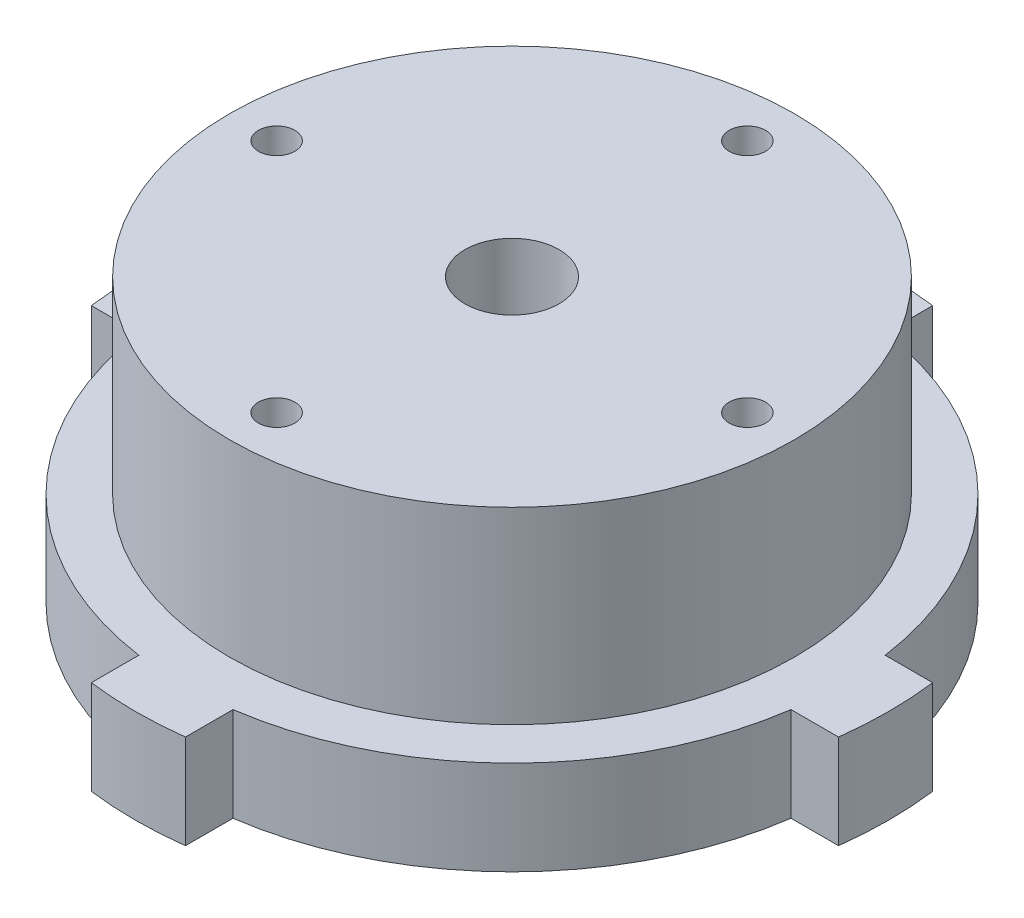
ISO-10303-21;
HEADER;
FILE_DESCRIPTION(('STEP AP214'),'2;1');
FILE_NAME('part.step','',(''),(''),'','','');
FILE_SCHEMA(('AUTOMOTIVE_DESIGN { 1 0 10303 214 1 1 1 1 }'));
ENDSEC;
DATA;
#1=APPLICATION_CONTEXT('core data for automotive mechanical design processes');
#2=APPLICATION_PROTOCOL_DEFINITION('international standard','automotive_design',2000,#1);
#3=PRODUCT_CONTEXT('',#1,'mechanical');
#4=PRODUCT('Part','Part','',(#3));
#5=PRODUCT_RELATED_PRODUCT_CATEGORY('part','',(#4));
#6=PRODUCT_DEFINITION_FORMATION('','',#4);
#7=PRODUCT_DEFINITION_CONTEXT('part definition',#1,'design');
#8=PRODUCT_DEFINITION('design','',#6,#7);
#9=PRODUCT_DEFINITION_SHAPE('','',#8);
#10=(LENGTH_UNIT() NAMED_UNIT(*) SI_UNIT(.MILLI.,.METRE.));
#11=(NAMED_UNIT(*) PLANE_ANGLE_UNIT() SI_UNIT($,.RADIAN.));
#12=(NAMED_UNIT(*) SI_UNIT($,.STERADIAN.) SOLID_ANGLE_UNIT());
#13=UNCERTAINTY_MEASURE_WITH_UNIT(LENGTH_MEASURE(1.E-05),#10,'distance_accuracy_value','');
#14=(GEOMETRIC_REPRESENTATION_CONTEXT(3) GLOBAL_UNCERTAINTY_ASSIGNED_CONTEXT((#13)) GLOBAL_UNIT_ASSIGNED_CONTEXT((#10,
#11,#12)) REPRESENTATION_CONTEXT('',''));
#15=CARTESIAN_POINT('',(0.,0.,0.));
#16=DIRECTION('',(0.,0.,1.));
#17=DIRECTION('',(1.,0.,0.));
#18=AXIS2_PLACEMENT_3D('',#15,#16,#17);
#19=CARTESIAN_POINT('',(0.,-12.7,0.));
#20=DIRECTION('',(0.,1.,0.));
#21=DIRECTION('',(0.,0.,1.));
#22=AXIS2_PLACEMENT_3D('',#19,#20,#21);
#23=PLANE('',#22);
#24=CARTESIAN_POINT('',(31.75,-12.7,3.32563597524808E-13));
#25=DIRECTION('',(0.,-1.,0.));
#26=DIRECTION('',(0.,0.,-1.));
#27=AXIS2_PLACEMENT_3D('',#24,#25,#26);
#28=CIRCLE('',#27,2.45744999999999);
#29=CARTESIAN_POINT('',(31.75,-12.7,-2.45744999999965));
#30=VERTEX_POINT('',#29);
#31=EDGE_CURVE('E563',#30,#30,#28,.T.);
#32=ORIENTED_EDGE('',*,*,#31,.F.);
#33=EDGE_LOOP('',(#32));
#34=FACE_BOUND('',#33,.T.);
#35=CARTESIAN_POINT('',(0.,-12.7,-31.75));
#36=DIRECTION('',(0.,-1.,0.));
#37=DIRECTION('',(0.,0.,-1.));
#38=AXIS2_PLACEMENT_3D('',#35,#36,#37);
#39=CIRCLE('',#38,2.45744999999999);
#40=CARTESIAN_POINT('',(0.,-12.7,-34.20745));
#41=VERTEX_POINT('',#40);
#42=EDGE_CURVE('E565',#41,#41,#39,.T.);
#43=ORIENTED_EDGE('',*,*,#42,.F.);
#44=EDGE_LOOP('',(#43));
#45=FACE_BOUND('',#44,.T.);
#46=CARTESIAN_POINT('',(-31.75,-12.7,-1.10854532508269E-13));
#47=DIRECTION('',(0.,-1.,0.));
#48=DIRECTION('',(0.,0.,-1.));
#49=AXIS2_PLACEMENT_3D('',#46,#47,#48);
#50=CIRCLE('',#49,2.45744999999999);
#51=CARTESIAN_POINT('',(-31.75,-12.7,-2.4574500000001));
#52=VERTEX_POINT('',#51);
#53=EDGE_CURVE('E573',#52,#52,#50,.T.);
#54=ORIENTED_EDGE('',*,*,#53,.F.);
#55=EDGE_LOOP('',(#54));
#56=FACE_BOUND('',#55,.T.);
#57=DIRECTION('',(-1.,0.,0.));
#58=VECTOR('',#57,1.);
#59=CARTESIAN_POINT('',(0.,-12.7,6.35000000000002));
#60=LINE('',#59,#58);
#61=CARTESIAN_POINT('',(50.4015624757804,-12.7,6.35000000000003));
#62=VERTEX_POINT('',#61);
#63=CARTESIAN_POINT('',(43.9940905122495,-12.7,6.35000000000003));
#64=VERTEX_POINT('',#63);
#65=EDGE_CURVE('E55',#62,#64,#60,.T.);
#66=ORIENTED_EDGE('',*,*,#65,.T.);
#67=CARTESIAN_POINT('',(0.,-12.7,0.));
#68=DIRECTION('',(0.,1.,0.));
#69=DIRECTION('',(0.,0.,1.));
#70=AXIS2_PLACEMENT_3D('',#67,#68,#69);
#71=CIRCLE('',#70,44.45);
#72=CARTESIAN_POINT('',(6.35,-12.7,43.9940905122495));
#73=VERTEX_POINT('',#72);
#74=EDGE_CURVE('E166',#73,#64,#71,.T.);
#75=ORIENTED_EDGE('',*,*,#74,.F.);
#76=DIRECTION('',(0.,0.,1.));
#77=VECTOR('',#76,1.);
#78=CARTESIAN_POINT('',(6.35,-12.7,0.));
#79=LINE('',#78,#77);
#80=CARTESIAN_POINT('',(6.35,-12.7,50.4015624757804));
#81=VERTEX_POINT('',#80);
#82=EDGE_CURVE('E161',#73,#81,#79,.T.);
#83=ORIENTED_EDGE('',*,*,#82,.T.);
#84=CARTESIAN_POINT('',(0.,-12.7,0.));
#85=DIRECTION('',(0.,1.,0.));
#86=DIRECTION('',(0.,0.,1.));
#87=AXIS2_PLACEMENT_3D('',#84,#85,#86);
#88=CIRCLE('',#87,50.8);
#89=CARTESIAN_POINT('',(-6.35,-12.7,50.4015624757804));
#90=VERTEX_POINT('',#89);
#91=EDGE_CURVE('E165',#90,#81,#88,.T.);
#92=ORIENTED_EDGE('',*,*,#91,.F.);
#93=DIRECTION('',(0.,0.,-1.));
#94=VECTOR('',#93,1.);
#95=CARTESIAN_POINT('',(-6.34999999999998,-12.7,0.));
#96=LINE('',#95,#94);
#97=CARTESIAN_POINT('',(-6.35,-12.7,43.9940905122495));
#98=VERTEX_POINT('',#97);
#99=EDGE_CURVE('E178',#90,#98,#96,.T.);
#100=ORIENTED_EDGE('',*,*,#99,.T.);
#101=CARTESIAN_POINT('',(0.,-12.7,0.));
#102=DIRECTION('',(0.,1.,0.));
#103=DIRECTION('',(0.,0.,1.));
#104=AXIS2_PLACEMENT_3D('',#101,#102,#103);
#105=CIRCLE('',#104,44.45);
#106=CARTESIAN_POINT('',(-43.9940905122495,-12.7,6.35000000000003));
#107=VERTEX_POINT('',#106);
#108=EDGE_CURVE('E182',#107,#98,#105,.T.);
#109=ORIENTED_EDGE('',*,*,#108,.F.);
#110=DIRECTION('',(-1.,0.,0.));
#111=VECTOR('',#110,1.);
#112=CARTESIAN_POINT('',(0.,-12.7,6.35000000000002));
#113=LINE('',#112,#111);
#114=CARTESIAN_POINT('',(-50.4015624757804,-12.7,6.35000000000003));
#115=VERTEX_POINT('',#114);
#116=EDGE_CURVE('E187',#107,#115,#113,.T.);
#117=ORIENTED_EDGE('',*,*,#116,.T.);
#118=CARTESIAN_POINT('',(-50.4015624757804,-12.7,-6.35000000000003));
#119=VERTEX_POINT('',#118);
#120=EDGE_CURVE('E180',#119,#115,#88,.T.);
#121=ORIENTED_EDGE('',*,*,#120,.F.);
#122=DIRECTION('',(1.,0.,0.));
#123=VECTOR('',#122,1.);
#124=CARTESIAN_POINT('',(0.,-12.7,-6.35000000000003));
#125=LINE('',#124,#123);
#126=CARTESIAN_POINT('',(-43.9940905122495,-12.7,-6.35000000000003));
#127=VERTEX_POINT('',#126);
#128=EDGE_CURVE('E188',#119,#127,#125,.T.);
#129=ORIENTED_EDGE('',*,*,#128,.T.);
#130=CARTESIAN_POINT('',(0.,-12.7,0.));
#131=DIRECTION('',(0.,1.,0.));
#132=DIRECTION('',(0.,0.,1.));
#133=AXIS2_PLACEMENT_3D('',#130,#131,#132);
#134=CIRCLE('',#133,44.45);
#135=CARTESIAN_POINT('',(-6.35,-12.7,-43.9940905122495));
#136=VERTEX_POINT('',#135);
#137=EDGE_CURVE('E198',#136,#127,#134,.T.);
#138=ORIENTED_EDGE('',*,*,#137,.F.);
#139=DIRECTION('',(0.,0.,-1.));
#140=VECTOR('',#139,1.);
#141=CARTESIAN_POINT('',(-6.35000000000001,-12.7,0.));
#142=LINE('',#141,#140);
#143=CARTESIAN_POINT('',(-6.35,-12.7,-50.4015624757804));
#144=VERTEX_POINT('',#143);
#145=EDGE_CURVE('E194',#136,#144,#142,.T.);
#146=ORIENTED_EDGE('',*,*,#145,.T.);
#147=CARTESIAN_POINT('',(6.35,-12.7,-50.4015624757804));
#148=VERTEX_POINT('',#147);
#149=EDGE_CURVE('E189',#148,#144,#88,.T.);
#150=ORIENTED_EDGE('',*,*,#149,.F.);
#151=DIRECTION('',(0.,0.,1.));
#152=VECTOR('',#151,1.);
#153=CARTESIAN_POINT('',(6.35,-12.7,0.));
#154=LINE('',#153,#152);
#155=CARTESIAN_POINT('',(6.35,-12.7,-43.9940905122495));
#156=VERTEX_POINT('',#155);
#157=EDGE_CURVE('E195',#148,#156,#154,.T.);
#158=ORIENTED_EDGE('',*,*,#157,.T.);
#159=CARTESIAN_POINT('',(0.,-12.7,0.));
#160=DIRECTION('',(0.,1.,0.));
#161=DIRECTION('',(0.,0.,1.));
#162=AXIS2_PLACEMENT_3D('',#159,#160,#161);
#163=CIRCLE('',#162,44.45);
#164=CARTESIAN_POINT('',(43.9940905122495,-12.7,-6.35000000000003));
#165=VERTEX_POINT('',#164);
#166=EDGE_CURVE('E191',#156,#165,#163,.F.);
#167=ORIENTED_EDGE('',*,*,#166,.T.);
#168=DIRECTION('',(1.,0.,0.));
#169=VECTOR('',#168,1.);
#170=CARTESIAN_POINT('',(0.,-12.7,-6.35000000000003));
#171=LINE('',#170,#169);
#172=CARTESIAN_POINT('',(50.4015624757804,-12.7,-6.35000000000003));
#173=VERTEX_POINT('',#172);
#174=EDGE_CURVE('E190',#165,#173,#171,.T.);
#175=ORIENTED_EDGE('',*,*,#174,.T.);
#176=EDGE_CURVE('E181',#62,#173,#88,.T.);
#177=ORIENTED_EDGE('',*,*,#176,.F.);
#178=EDGE_LOOP('',(#66,#75,#83,#92,#100,#109,#117,#121,#129,#138,#146,#150,#158,#167,#175,#177));
#179=FACE_BOUND('',#178,.T.);
#180=CARTESIAN_POINT('',(0.,-12.7,0.));
#181=DIRECTION('',(0.,1.,0.));
#182=DIRECTION('',(0.,0.,1.));
#183=AXIS2_PLACEMENT_3D('',#180,#181,#182);
#184=CIRCLE('',#183,6.35);
#185=CARTESIAN_POINT('',(0.,-12.7,6.35));
#186=VERTEX_POINT('',#185);
#187=EDGE_CURVE('E212',#186,#186,#184,.T.);
#188=ORIENTED_EDGE('',*,*,#187,.T.);
#189=EDGE_LOOP('',(#188));
#190=FACE_BOUND('',#189,.T.);
#191=CARTESIAN_POINT('',(0.,-12.7,31.75));
#192=DIRECTION('',(0.,-1.,0.));
#193=DIRECTION('',(0.,0.,-1.));
#194=AXIS2_PLACEMENT_3D('',#191,#192,#193);
#195=CIRCLE('',#194,2.45744999999999);
#196=CARTESIAN_POINT('',(0.,-12.7,29.29255));
#197=VERTEX_POINT('',#196);
#198=EDGE_CURVE('E579',#197,#197,#195,.T.);
#199=ORIENTED_EDGE('',*,*,#198,.F.);
#200=EDGE_LOOP('',(#199));
#201=FACE_BOUND('',#200,.T.);
#202=ADVANCED_FACE('F37',(#34,#45,#56,#179,#190,#201),#23,.F.);
#203=CARTESIAN_POINT('',(0.,25.4,0.));
#204=DIRECTION('',(0.,-1.,0.));
#205=DIRECTION('',(0.,0.,-1.));
#206=AXIS2_PLACEMENT_3D('',#203,#204,#205);
#207=CYLINDRICAL_SURFACE('',#206,6.35);
#208=CARTESIAN_POINT('',(0.,25.4,0.));
#209=DIRECTION('',(0.,1.,0.));
#210=DIRECTION('',(0.,0.,1.));
#211=AXIS2_PLACEMENT_3D('',#208,#209,#210);
#212=CIRCLE('',#211,6.35);
#213=CARTESIAN_POINT('',(0.,25.4,6.35));
#214=VERTEX_POINT('',#213);
#215=EDGE_CURVE('E47',#214,#214,#212,.T.);
#216=ORIENTED_EDGE('',*,*,#215,.T.);
#217=EDGE_LOOP('',(#216));
#218=FACE_BOUND('',#217,.T.);
#219=ORIENTED_EDGE('',*,*,#187,.F.);
#220=EDGE_LOOP('',(#219));
#221=FACE_BOUND('',#220,.T.);
#222=ADVANCED_FACE('F39',(#218,#221),#207,.F.);
#223=CARTESIAN_POINT('',(0.,25.4,0.));
#224=DIRECTION('',(0.,-1.,0.));
#225=DIRECTION('',(0.,0.,-1.));
#226=AXIS2_PLACEMENT_3D('',#223,#224,#225);
#227=CYLINDRICAL_SURFACE('',#226,38.1);
#228=CARTESIAN_POINT('',(0.,25.4,0.));
#229=DIRECTION('',(0.,1.,0.));
#230=DIRECTION('',(0.,0.,1.));
#231=AXIS2_PLACEMENT_3D('',#228,#229,#230);
#232=CIRCLE('',#231,38.1);
#233=CARTESIAN_POINT('',(0.,25.4,38.1));
#234=VERTEX_POINT('',#233);
#235=EDGE_CURVE('E11',#234,#234,#232,.T.);
#236=ORIENTED_EDGE('',*,*,#235,.F.);
#237=EDGE_LOOP('',(#236));
#238=FACE_BOUND('',#237,.T.);
#239=CARTESIAN_POINT('',(0.,0.,0.));
#240=DIRECTION('',(0.,1.,0.));
#241=DIRECTION('',(0.,0.,1.));
#242=AXIS2_PLACEMENT_3D('',#239,#240,#241);
#243=CIRCLE('',#242,38.1);
#244=CARTESIAN_POINT('',(0.,0.,38.1));
#245=VERTEX_POINT('',#244);
#246=EDGE_CURVE('E41',#245,#245,#243,.T.);
#247=ORIENTED_EDGE('',*,*,#246,.T.);
#248=EDGE_LOOP('',(#247));
#249=FACE_BOUND('',#248,.T.);
#250=ADVANCED_FACE('F286',(#238,#249),#227,.T.);
#251=CARTESIAN_POINT('',(0.,25.4,0.));
#252=DIRECTION('',(0.,1.,0.));
#253=DIRECTION('',(0.,0.,1.));
#254=AXIS2_PLACEMENT_3D('',#251,#252,#253);
#255=PLANE('',#254);
#256=CARTESIAN_POINT('',(31.75,25.4,3.32563597524808E-13));
#257=DIRECTION('',(0.,-1.,0.));
#258=DIRECTION('',(0.,0.,-1.));
#259=AXIS2_PLACEMENT_3D('',#256,#257,#258);
#260=CIRCLE('',#259,2.45744999999999);
#261=CARTESIAN_POINT('',(31.75,25.4,-2.45744999999966));
#262=VERTEX_POINT('',#261);
#263=EDGE_CURVE('E561',#262,#262,#260,.T.);
#264=ORIENTED_EDGE('',*,*,#263,.T.);
#265=EDGE_LOOP('',(#264));
#266=FACE_BOUND('',#265,.T.);
#267=CARTESIAN_POINT('',(0.,25.4,-31.75));
#268=DIRECTION('',(0.,-1.,0.));
#269=DIRECTION('',(0.,0.,-1.));
#270=AXIS2_PLACEMENT_3D('',#267,#268,#269);
#271=CIRCLE('',#270,2.45744999999999);
#272=CARTESIAN_POINT('',(0.,25.4,-34.20745));
#273=VERTEX_POINT('',#272);
#274=EDGE_CURVE('E570',#273,#273,#271,.T.);
#275=ORIENTED_EDGE('',*,*,#274,.T.);
#276=EDGE_LOOP('',(#275));
#277=FACE_BOUND('',#276,.T.);
#278=CARTESIAN_POINT('',(-31.75,25.4,-1.10854532508269E-13));
#279=DIRECTION('',(0.,-1.,0.));
#280=DIRECTION('',(0.,0.,-1.));
#281=AXIS2_PLACEMENT_3D('',#278,#279,#280);
#282=CIRCLE('',#281,2.45744999999999);
#283=CARTESIAN_POINT('',(-31.75,25.4,-2.4574500000001));
#284=VERTEX_POINT('',#283);
#285=EDGE_CURVE('E576',#284,#284,#282,.T.);
#286=ORIENTED_EDGE('',*,*,#285,.T.);
#287=EDGE_LOOP('',(#286));
#288=FACE_BOUND('',#287,.T.);
#289=CARTESIAN_POINT('',(0.,25.4,31.75));
#290=DIRECTION('',(0.,-1.,0.));
#291=DIRECTION('',(0.,0.,-1.));
#292=AXIS2_PLACEMENT_3D('',#289,#290,#291);
#293=CIRCLE('',#292,2.45744999999999);
#294=CARTESIAN_POINT('',(0.,25.4,29.29255));
#295=VERTEX_POINT('',#294);
#296=EDGE_CURVE('E218',#295,#295,#293,.T.);
#297=ORIENTED_EDGE('',*,*,#296,.T.);
#298=EDGE_LOOP('',(#297));
#299=FACE_BOUND('',#298,.T.);
#300=ORIENTED_EDGE('',*,*,#215,.F.);
#301=EDGE_LOOP('',(#300));
#302=FACE_BOUND('',#301,.T.);
#303=ORIENTED_EDGE('',*,*,#235,.T.);
#304=EDGE_LOOP('',(#303));
#305=FACE_BOUND('',#304,.T.);
#306=ADVANCED_FACE('F413',(#266,#277,#288,#299,#302,#305),#255,.T.);
#307=CARTESIAN_POINT('',(0.,-12.7,6.35000000000002));
#308=DIRECTION('',(0.,0.,-1.));
#309=DIRECTION('',(-1.,0.,0.));
#310=AXIS2_PLACEMENT_3D('',#307,#308,#309);
#311=PLANE('',#310);
#312=DIRECTION('',(-1.,0.,0.));
#313=VECTOR('',#312,1.);
#314=CARTESIAN_POINT('',(0.,0.,6.35000000000002));
#315=LINE('',#314,#313);
#316=CARTESIAN_POINT('',(50.4015624757804,0.,6.35000000000003));
#317=VERTEX_POINT('',#316);
#318=CARTESIAN_POINT('',(43.9940905122495,0.,6.35000000000003));
#319=VERTEX_POINT('',#318);
#320=EDGE_CURVE('E215',#317,#319,#315,.T.);
#321=ORIENTED_EDGE('',*,*,#320,.T.);
#322=DIRECTION('',(0.,1.,0.));
#323=VECTOR('',#322,1.);
#324=CARTESIAN_POINT('',(43.9940905122495,-12.7,6.35000000000003));
#325=LINE('',#324,#323);
#326=EDGE_CURVE('E115',#64,#319,#325,.T.);
#327=ORIENTED_EDGE('',*,*,#326,.F.);
#328=ORIENTED_EDGE('',*,*,#65,.F.);
#329=DIRECTION('',(0.,1.,0.));
#330=VECTOR('',#329,1.);
#331=CARTESIAN_POINT('',(50.4015624757804,-12.7,6.35000000000003));
#332=LINE('',#331,#330);
#333=EDGE_CURVE('E123',#62,#317,#332,.T.);
#334=ORIENTED_EDGE('',*,*,#333,.T.);
#335=EDGE_LOOP('',(#321,#327,#328,#334));
#336=FACE_BOUND('',#335,.T.);
#337=ADVANCED_FACE('F367',(#336),#311,.F.);
#338=CARTESIAN_POINT('',(0.,-12.7,0.));
#339=DIRECTION('',(0.,1.,0.));
#340=DIRECTION('',(0.,0.,1.));
#341=AXIS2_PLACEMENT_3D('',#338,#339,#340);
#342=CYLINDRICAL_SURFACE('',#341,44.45);
#343=CARTESIAN_POINT('',(0.,0.,0.));
#344=DIRECTION('',(0.,1.,0.));
#345=DIRECTION('',(0.,0.,1.));
#346=AXIS2_PLACEMENT_3D('',#343,#344,#345);
#347=CIRCLE('',#346,44.45);
#348=CARTESIAN_POINT('',(6.35,0.,43.9940905122495));
#349=VERTEX_POINT('',#348);
#350=EDGE_CURVE('E192',#349,#319,#347,.T.);
#351=ORIENTED_EDGE('',*,*,#350,.F.);
#352=DIRECTION('',(0.,1.,0.));
#353=VECTOR('',#352,1.);
#354=CARTESIAN_POINT('',(6.35,-12.7,43.9940905122495));
#355=LINE('',#354,#353);
#356=EDGE_CURVE('E108',#73,#349,#355,.T.);
#357=ORIENTED_EDGE('',*,*,#356,.F.);
#358=ORIENTED_EDGE('',*,*,#74,.T.);
#359=ORIENTED_EDGE('',*,*,#326,.T.);
#360=EDGE_LOOP('',(#351,#357,#358,#359));
#361=FACE_BOUND('',#360,.T.);
#362=ADVANCED_FACE('F364',(#361),#342,.T.);
#363=CARTESIAN_POINT('',(6.35,-12.7,0.));
#364=DIRECTION('',(-1.,0.,0.));
#365=DIRECTION('',(0.,0.,1.));
#366=AXIS2_PLACEMENT_3D('',#363,#364,#365);
#367=PLANE('',#366);
#368=DIRECTION('',(0.,0.,1.));
#369=VECTOR('',#368,1.);
#370=CARTESIAN_POINT('',(6.35,0.,0.));
#371=LINE('',#370,#369);
#372=CARTESIAN_POINT('',(6.35,0.,50.4015624757804));
#373=VERTEX_POINT('',#372);
#374=EDGE_CURVE('E170',#349,#373,#371,.T.);
#375=ORIENTED_EDGE('',*,*,#374,.T.);
#376=DIRECTION('',(0.,1.,0.));
#377=VECTOR('',#376,1.);
#378=CARTESIAN_POINT('',(6.35,-12.7,50.4015624757804));
#379=LINE('',#378,#377);
#380=EDGE_CURVE('E168',#81,#373,#379,.T.);
#381=ORIENTED_EDGE('',*,*,#380,.F.);
#382=ORIENTED_EDGE('',*,*,#82,.F.);
#383=ORIENTED_EDGE('',*,*,#356,.T.);
#384=EDGE_LOOP('',(#375,#381,#382,#383));
#385=FACE_BOUND('',#384,.T.);
#386=ADVANCED_FACE('F169',(#385),#367,.F.);
#387=CARTESIAN_POINT('',(0.,-12.7,0.));
#388=DIRECTION('',(0.,1.,0.));
#389=DIRECTION('',(0.,0.,1.));
#390=AXIS2_PLACEMENT_3D('',#387,#388,#389);
#391=CYLINDRICAL_SURFACE('',#390,50.8);
#392=CARTESIAN_POINT('',(0.,0.,0.));
#393=DIRECTION('',(0.,1.,0.));
#394=DIRECTION('',(0.,0.,1.));
#395=AXIS2_PLACEMENT_3D('',#392,#393,#394);
#396=CIRCLE('',#395,50.8);
#397=CARTESIAN_POINT('',(-6.35,0.,50.4015624757804));
#398=VERTEX_POINT('',#397);
#399=EDGE_CURVE('E222',#398,#373,#396,.T.);
#400=ORIENTED_EDGE('',*,*,#399,.F.);
#401=DIRECTION('',(0.,1.,0.));
#402=VECTOR('',#401,1.);
#403=CARTESIAN_POINT('',(-6.35,-12.7,50.4015624757804));
#404=LINE('',#403,#402);
#405=EDGE_CURVE('E174',#90,#398,#404,.T.);
#406=ORIENTED_EDGE('',*,*,#405,.F.);
#407=ORIENTED_EDGE('',*,*,#91,.T.);
#408=ORIENTED_EDGE('',*,*,#380,.T.);
#409=EDGE_LOOP('',(#400,#406,#407,#408));
#410=FACE_BOUND('',#409,.T.);
#411=ADVANCED_FACE('F176',(#410),#391,.T.);
#412=CARTESIAN_POINT('',(-6.34999999999998,-12.7,0.));
#413=DIRECTION('',(1.,0.,0.));
#414=DIRECTION('',(0.,0.,-1.));
#415=AXIS2_PLACEMENT_3D('',#412,#413,#414);
#416=PLANE('',#415);
#417=DIRECTION('',(0.,0.,-1.));
#418=VECTOR('',#417,1.);
#419=CARTESIAN_POINT('',(-6.34999999999998,0.,0.));
#420=LINE('',#419,#418);
#421=CARTESIAN_POINT('',(-6.35,0.,43.9940905122495));
#422=VERTEX_POINT('',#421);
#423=EDGE_CURVE('E246',#398,#422,#420,.T.);
#424=ORIENTED_EDGE('',*,*,#423,.T.);
#425=DIRECTION('',(0.,1.,0.));
#426=VECTOR('',#425,1.);
#427=CARTESIAN_POINT('',(-6.35,-12.7,43.9940905122495));
#428=LINE('',#427,#426);
#429=EDGE_CURVE('E255',#98,#422,#428,.T.);
#430=ORIENTED_EDGE('',*,*,#429,.F.);
#431=ORIENTED_EDGE('',*,*,#99,.F.);
#432=ORIENTED_EDGE('',*,*,#405,.T.);
#433=EDGE_LOOP('',(#424,#430,#431,#432));
#434=FACE_BOUND('',#433,.T.);
#435=ADVANCED_FACE('F322',(#434),#416,.F.);
#436=CARTESIAN_POINT('',(0.,-12.7,0.));
#437=DIRECTION('',(0.,1.,0.));
#438=DIRECTION('',(0.,0.,1.));
#439=AXIS2_PLACEMENT_3D('',#436,#437,#438);
#440=CYLINDRICAL_SURFACE('',#439,44.45);
#441=CARTESIAN_POINT('',(0.,0.,0.));
#442=DIRECTION('',(0.,1.,0.));
#443=DIRECTION('',(0.,0.,1.));
#444=AXIS2_PLACEMENT_3D('',#441,#442,#443);
#445=CIRCLE('',#444,44.45);
#446=CARTESIAN_POINT('',(-43.9940905122495,0.,6.35000000000003));
#447=VERTEX_POINT('',#446);
#448=EDGE_CURVE('E243',#447,#422,#445,.T.);
#449=ORIENTED_EDGE('',*,*,#448,.F.);
#450=DIRECTION('',(0.,1.,0.));
#451=VECTOR('',#450,1.);
#452=CARTESIAN_POINT('',(-43.9940905122495,-12.7,6.35000000000003));
#453=LINE('',#452,#451);
#454=EDGE_CURVE('E257',#107,#447,#453,.T.);
#455=ORIENTED_EDGE('',*,*,#454,.F.);
#456=ORIENTED_EDGE('',*,*,#108,.T.);
#457=ORIENTED_EDGE('',*,*,#429,.T.);
#458=EDGE_LOOP('',(#449,#455,#456,#457));
#459=FACE_BOUND('',#458,.T.);
#460=ADVANCED_FACE('F328',(#459),#440,.T.);
#461=CARTESIAN_POINT('',(0.,-12.7,6.35000000000002));
#462=DIRECTION('',(0.,0.,-1.));
#463=DIRECTION('',(-1.,0.,0.));
#464=AXIS2_PLACEMENT_3D('',#461,#462,#463);
#465=PLANE('',#464);
#466=DIRECTION('',(-1.,0.,0.));
#467=VECTOR('',#466,1.);
#468=CARTESIAN_POINT('',(0.,0.,6.35000000000002));
#469=LINE('',#468,#467);
#470=CARTESIAN_POINT('',(-50.4015624757804,0.,6.35000000000003));
#471=VERTEX_POINT('',#470);
#472=EDGE_CURVE('E240',#447,#471,#469,.T.);
#473=ORIENTED_EDGE('',*,*,#472,.T.);
#474=DIRECTION('',(0.,1.,0.));
#475=VECTOR('',#474,1.);
#476=CARTESIAN_POINT('',(-50.4015624757804,-12.7,6.35000000000003));
#477=LINE('',#476,#475);
#478=EDGE_CURVE('E259',#115,#471,#477,.T.);
#479=ORIENTED_EDGE('',*,*,#478,.F.);
#480=ORIENTED_EDGE('',*,*,#116,.F.);
#481=ORIENTED_EDGE('',*,*,#454,.T.);
#482=EDGE_LOOP('',(#473,#479,#480,#481));
#483=FACE_BOUND('',#482,.T.);
#484=ADVANCED_FACE('F330',(#483),#465,.F.);
#485=CARTESIAN_POINT('',(-50.4015624757804,0.,-6.35000000000003));
#486=VERTEX_POINT('',#485);
#487=EDGE_CURVE('E239',#486,#471,#396,.T.);
#488=ORIENTED_EDGE('',*,*,#487,.F.);
#489=DIRECTION('',(0.,1.,0.));
#490=VECTOR('',#489,1.);
#491=CARTESIAN_POINT('',(-50.4015624757804,-12.7,-6.35000000000003));
#492=LINE('',#491,#490);
#493=EDGE_CURVE('E261',#119,#486,#492,.T.);
#494=ORIENTED_EDGE('',*,*,#493,.F.);
#495=ORIENTED_EDGE('',*,*,#120,.T.);
#496=ORIENTED_EDGE('',*,*,#478,.T.);
#497=EDGE_LOOP('',(#488,#494,#495,#496));
#498=FACE_BOUND('',#497,.T.);
#499=ADVANCED_FACE('F332',(#498),#391,.T.);
#500=CARTESIAN_POINT('',(0.,-12.7,-6.35000000000003));
#501=DIRECTION('',(0.,0.,1.));
#502=DIRECTION('',(1.,0.,0.));
#503=AXIS2_PLACEMENT_3D('',#500,#501,#502);
#504=PLANE('',#503);
#505=DIRECTION('',(1.,0.,0.));
#506=VECTOR('',#505,1.);
#507=CARTESIAN_POINT('',(0.,0.,-6.35000000000003));
#508=LINE('',#507,#506);
#509=CARTESIAN_POINT('',(-43.9940905122495,0.,-6.35000000000003));
#510=VERTEX_POINT('',#509);
#511=EDGE_CURVE('E236',#486,#510,#508,.T.);
#512=ORIENTED_EDGE('',*,*,#511,.T.);
#513=DIRECTION('',(0.,1.,0.));
#514=VECTOR('',#513,1.);
#515=CARTESIAN_POINT('',(-43.9940905122495,-12.7,-6.35000000000003));
#516=LINE('',#515,#514);
#517=EDGE_CURVE('E263',#127,#510,#516,.T.);
#518=ORIENTED_EDGE('',*,*,#517,.F.);
#519=ORIENTED_EDGE('',*,*,#128,.F.);
#520=ORIENTED_EDGE('',*,*,#493,.T.);
#521=EDGE_LOOP('',(#512,#518,#519,#520));
#522=FACE_BOUND('',#521,.T.);
#523=ADVANCED_FACE('F337',(#522),#504,.F.);
#524=CARTESIAN_POINT('',(0.,-12.7,0.));
#525=DIRECTION('',(0.,1.,0.));
#526=DIRECTION('',(0.,0.,1.));
#527=AXIS2_PLACEMENT_3D('',#524,#525,#526);
#528=CYLINDRICAL_SURFACE('',#527,44.45);
#529=CARTESIAN_POINT('',(0.,0.,0.));
#530=DIRECTION('',(0.,1.,0.));
#531=DIRECTION('',(0.,0.,1.));
#532=AXIS2_PLACEMENT_3D('',#529,#530,#531);
#533=CIRCLE('',#532,44.45);
#534=CARTESIAN_POINT('',(-6.35,0.,-43.9940905122495));
#535=VERTEX_POINT('',#534);
#536=EDGE_CURVE('E233',#535,#510,#533,.T.);
#537=ORIENTED_EDGE('',*,*,#536,.F.);
#538=DIRECTION('',(0.,1.,0.));
#539=VECTOR('',#538,1.);
#540=CARTESIAN_POINT('',(-6.35,-12.7,-43.9940905122495));
#541=LINE('',#540,#539);
#542=EDGE_CURVE('E265',#136,#535,#541,.T.);
#543=ORIENTED_EDGE('',*,*,#542,.F.);
#544=ORIENTED_EDGE('',*,*,#137,.T.);
#545=ORIENTED_EDGE('',*,*,#517,.T.);
#546=EDGE_LOOP('',(#537,#543,#544,#545));
#547=FACE_BOUND('',#546,.T.);
#548=ADVANCED_FACE('F340',(#547),#528,.T.);
#549=CARTESIAN_POINT('',(-6.35000000000001,-12.7,0.));
#550=DIRECTION('',(1.,0.,0.));
#551=DIRECTION('',(0.,0.,-1.));
#552=AXIS2_PLACEMENT_3D('',#549,#550,#551);
#553=PLANE('',#552);
#554=DIRECTION('',(0.,0.,-1.));
#555=VECTOR('',#554,1.);
#556=CARTESIAN_POINT('',(-6.35000000000001,0.,0.));
#557=LINE('',#556,#555);
#558=CARTESIAN_POINT('',(-6.35,0.,-50.4015624757804));
#559=VERTEX_POINT('',#558);
#560=EDGE_CURVE('E230',#535,#559,#557,.T.);
#561=ORIENTED_EDGE('',*,*,#560,.T.);
#562=DIRECTION('',(0.,1.,0.));
#563=VECTOR('',#562,1.);
#564=CARTESIAN_POINT('',(-6.35,-12.7,-50.4015624757804));
#565=LINE('',#564,#563);
#566=EDGE_CURVE('E267',#144,#559,#565,.T.);
#567=ORIENTED_EDGE('',*,*,#566,.F.);
#568=ORIENTED_EDGE('',*,*,#145,.F.);
#569=ORIENTED_EDGE('',*,*,#542,.T.);
#570=EDGE_LOOP('',(#561,#567,#568,#569));
#571=FACE_BOUND('',#570,.T.);
#572=ADVANCED_FACE('F343',(#571),#553,.F.);
#573=CARTESIAN_POINT('',(6.35,0.,-50.4015624757804));
#574=VERTEX_POINT('',#573);
#575=EDGE_CURVE('E223',#574,#559,#396,.T.);
#576=ORIENTED_EDGE('',*,*,#575,.F.);
#577=DIRECTION('',(0.,1.,0.));
#578=VECTOR('',#577,1.);
#579=CARTESIAN_POINT('',(6.35,-12.7,-50.4015624757804));
#580=LINE('',#579,#578);
#581=EDGE_CURVE('E269',#148,#574,#580,.T.);
#582=ORIENTED_EDGE('',*,*,#581,.F.);
#583=ORIENTED_EDGE('',*,*,#149,.T.);
#584=ORIENTED_EDGE('',*,*,#566,.T.);
#585=EDGE_LOOP('',(#576,#582,#583,#584));
#586=FACE_BOUND('',#585,.T.);
#587=ADVANCED_FACE('F311',(#586),#391,.T.);
#588=CARTESIAN_POINT('',(6.35,-12.7,0.));
#589=DIRECTION('',(-1.,0.,0.));
#590=DIRECTION('',(0.,0.,1.));
#591=AXIS2_PLACEMENT_3D('',#588,#589,#590);
#592=PLANE('',#591);
#593=DIRECTION('',(0.,0.,1.));
#594=VECTOR('',#593,1.);
#595=CARTESIAN_POINT('',(6.35,0.,0.));
#596=LINE('',#595,#594);
#597=CARTESIAN_POINT('',(6.35,0.,-43.9940905122495));
#598=VERTEX_POINT('',#597);
#599=EDGE_CURVE('E228',#574,#598,#596,.T.);
#600=ORIENTED_EDGE('',*,*,#599,.T.);
#601=DIRECTION('',(0.,1.,0.));
#602=VECTOR('',#601,1.);
#603=CARTESIAN_POINT('',(6.35,-12.7,-43.9940905122495));
#604=LINE('',#603,#602);
#605=EDGE_CURVE('E271',#156,#598,#604,.T.);
#606=ORIENTED_EDGE('',*,*,#605,.F.);
#607=ORIENTED_EDGE('',*,*,#157,.F.);
#608=ORIENTED_EDGE('',*,*,#581,.T.);
#609=EDGE_LOOP('',(#600,#606,#607,#608));
#610=FACE_BOUND('',#609,.T.);
#611=ADVANCED_FACE('F310',(#610),#592,.F.);
#612=CARTESIAN_POINT('',(0.,-12.7,0.));
#613=DIRECTION('',(0.,1.,0.));
#614=DIRECTION('',(0.,0.,1.));
#615=AXIS2_PLACEMENT_3D('',#612,#613,#614);
#616=CYLINDRICAL_SURFACE('',#615,44.45);
#617=CARTESIAN_POINT('',(0.,0.,0.));
#618=DIRECTION('',(0.,1.,0.));
#619=DIRECTION('',(0.,0.,1.));
#620=AXIS2_PLACEMENT_3D('',#617,#618,#619);
#621=CIRCLE('',#620,44.45);
#622=CARTESIAN_POINT('',(43.9940905122495,0.,-6.35000000000003));
#623=VERTEX_POINT('',#622);
#624=EDGE_CURVE('E226',#598,#623,#621,.F.);
#625=ORIENTED_EDGE('',*,*,#624,.T.);
#626=DIRECTION('',(0.,1.,0.));
#627=VECTOR('',#626,1.);
#628=CARTESIAN_POINT('',(43.9940905122495,-12.7,-6.35000000000003));
#629=LINE('',#628,#627);
#630=EDGE_CURVE('E274',#165,#623,#629,.T.);
#631=ORIENTED_EDGE('',*,*,#630,.F.);
#632=ORIENTED_EDGE('',*,*,#166,.F.);
#633=ORIENTED_EDGE('',*,*,#605,.T.);
#634=EDGE_LOOP('',(#625,#631,#632,#633));
#635=FACE_BOUND('',#634,.T.);
#636=ADVANCED_FACE('F307',(#635),#616,.T.);
#637=CARTESIAN_POINT('',(0.,-12.7,-6.35000000000003));
#638=DIRECTION('',(0.,0.,1.));
#639=DIRECTION('',(1.,0.,0.));
#640=AXIS2_PLACEMENT_3D('',#637,#638,#639);
#641=PLANE('',#640);
#642=DIRECTION('',(1.,0.,0.));
#643=VECTOR('',#642,1.);
#644=CARTESIAN_POINT('',(0.,0.,-6.35000000000003));
#645=LINE('',#644,#643);
#646=CARTESIAN_POINT('',(50.4015624757804,0.,-6.35000000000003));
#647=VERTEX_POINT('',#646);
#648=EDGE_CURVE('E221',#623,#647,#645,.T.);
#649=ORIENTED_EDGE('',*,*,#648,.T.);
#650=DIRECTION('',(0.,1.,0.));
#651=VECTOR('',#650,1.);
#652=CARTESIAN_POINT('',(50.4015624757804,-12.7,-6.35000000000003));
#653=LINE('',#652,#651);
#654=EDGE_CURVE('E277',#173,#647,#653,.T.);
#655=ORIENTED_EDGE('',*,*,#654,.F.);
#656=ORIENTED_EDGE('',*,*,#174,.F.);
#657=ORIENTED_EDGE('',*,*,#630,.T.);
#658=EDGE_LOOP('',(#649,#655,#656,#657));
#659=FACE_BOUND('',#658,.T.);
#660=ADVANCED_FACE('F300',(#659),#641,.F.);
#661=EDGE_CURVE('E217',#317,#647,#396,.T.);
#662=ORIENTED_EDGE('',*,*,#661,.F.);
#663=ORIENTED_EDGE('',*,*,#333,.F.);
#664=ORIENTED_EDGE('',*,*,#176,.T.);
#665=ORIENTED_EDGE('',*,*,#654,.T.);
#666=EDGE_LOOP('',(#662,#663,#664,#665));
#667=FACE_BOUND('',#666,.T.);
#668=ADVANCED_FACE('F292',(#667),#391,.T.);
#669=CARTESIAN_POINT('',(0.,0.,0.));
#670=DIRECTION('',(0.,1.,0.));
#671=DIRECTION('',(0.,0.,1.));
#672=AXIS2_PLACEMENT_3D('',#669,#670,#671);
#673=PLANE('',#672);
#674=ORIENTED_EDGE('',*,*,#246,.F.);
#675=EDGE_LOOP('',(#674));
#676=FACE_BOUND('',#675,.T.);
#677=ORIENTED_EDGE('',*,*,#320,.F.);
#678=ORIENTED_EDGE('',*,*,#661,.T.);
#679=ORIENTED_EDGE('',*,*,#648,.F.);
#680=ORIENTED_EDGE('',*,*,#624,.F.);
#681=ORIENTED_EDGE('',*,*,#599,.F.);
#682=ORIENTED_EDGE('',*,*,#575,.T.);
#683=ORIENTED_EDGE('',*,*,#560,.F.);
#684=ORIENTED_EDGE('',*,*,#536,.T.);
#685=ORIENTED_EDGE('',*,*,#511,.F.);
#686=ORIENTED_EDGE('',*,*,#487,.T.);
#687=ORIENTED_EDGE('',*,*,#472,.F.);
#688=ORIENTED_EDGE('',*,*,#448,.T.);
#689=ORIENTED_EDGE('',*,*,#423,.F.);
#690=ORIENTED_EDGE('',*,*,#399,.T.);
#691=ORIENTED_EDGE('',*,*,#374,.F.);
#692=ORIENTED_EDGE('',*,*,#350,.T.);
#693=EDGE_LOOP('',(#677,#678,#679,#680,#681,#682,#683,#684,#685,#686,#687,#688,#689,#690,#691,#692));
#694=FACE_BOUND('',#693,.T.);
#695=ADVANCED_FACE('F288',(#676,#694),#673,.T.);
#696=CARTESIAN_POINT('',(0.,-12.7,31.75));
#697=DIRECTION('',(0.,-1.,0.));
#698=DIRECTION('',(0.,0.,-1.));
#699=AXIS2_PLACEMENT_3D('',#696,#697,#698);
#700=CYLINDRICAL_SURFACE('',#699,2.45744999999999);
#701=ORIENTED_EDGE('',*,*,#296,.F.);
#702=EDGE_LOOP('',(#701));
#703=FACE_BOUND('',#702,.T.);
#704=ORIENTED_EDGE('',*,*,#198,.T.);
#705=EDGE_LOOP('',(#704));
#706=FACE_BOUND('',#705,.T.);
#707=ADVANCED_FACE('F291',(#703,#706),#700,.F.);
#708=CARTESIAN_POINT('',(-31.75,-12.7,-1.10854532508269E-13));
#709=DIRECTION('',(0.,-1.,0.));
#710=DIRECTION('',(0.,0.,-1.));
#711=AXIS2_PLACEMENT_3D('',#708,#709,#710);
#712=CYLINDRICAL_SURFACE('',#711,2.45744999999999);
#713=ORIENTED_EDGE('',*,*,#285,.F.);
#714=EDGE_LOOP('',(#713));
#715=FACE_BOUND('',#714,.T.);
#716=ORIENTED_EDGE('',*,*,#53,.T.);
#717=EDGE_LOOP('',(#716));
#718=FACE_BOUND('',#717,.T.);
#719=ADVANCED_FACE('F522',(#715,#718),#712,.F.);
#720=CARTESIAN_POINT('',(0.,-12.7,-31.75));
#721=DIRECTION('',(0.,-1.,0.));
#722=DIRECTION('',(0.,0.,-1.));
#723=AXIS2_PLACEMENT_3D('',#720,#721,#722);
#724=CYLINDRICAL_SURFACE('',#723,2.45744999999999);
#725=ORIENTED_EDGE('',*,*,#274,.F.);
#726=EDGE_LOOP('',(#725));
#727=FACE_BOUND('',#726,.T.);
#728=ORIENTED_EDGE('',*,*,#42,.T.);
#729=EDGE_LOOP('',(#728));
#730=FACE_BOUND('',#729,.T.);
#731=ADVANCED_FACE('F529',(#727,#730),#724,.F.);
#732=CARTESIAN_POINT('',(31.75,-12.7,3.32563597524808E-13));
#733=DIRECTION('',(0.,-1.,0.));
#734=DIRECTION('',(0.,0.,-1.));
#735=AXIS2_PLACEMENT_3D('',#732,#733,#734);
#736=CYLINDRICAL_SURFACE('',#735,2.45744999999999);
#737=ORIENTED_EDGE('',*,*,#263,.F.);
#738=EDGE_LOOP('',(#737));
#739=FACE_BOUND('',#738,.T.);
#740=ORIENTED_EDGE('',*,*,#31,.T.);
#741=EDGE_LOOP('',(#740));
#742=FACE_BOUND('',#741,.T.);
#743=ADVANCED_FACE('F537',(#739,#742),#736,.F.);
#744=CLOSED_SHELL('',(#202,#222,#250,#306,#337,#362,#386,#411,#435,#460,#484,#499,#523,#548,
#572,#587,#611,#636,#660,#668,#695,#707,#719,#731,#743));
#745=MANIFOLD_SOLID_BREP('B2',#744);
#746=ADVANCED_BREP_SHAPE_REPRESENTATION('',(#18,#745),#14);
#747=SHAPE_DEFINITION_REPRESENTATION(#9,#746);
ENDSEC;
END-ISO-10303-21;
